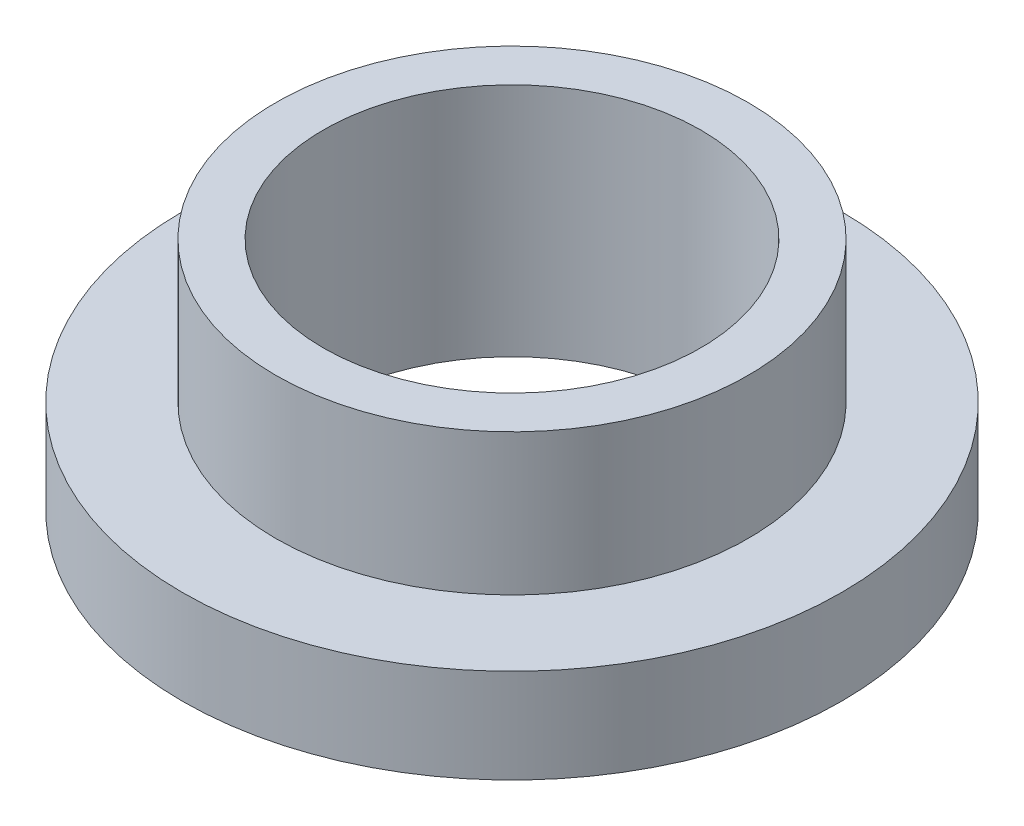
ISO-10303-21;
HEADER;
FILE_DESCRIPTION(('STEP AP214'),'2;1');
FILE_NAME('part.step','',(''),(''),'','','');
FILE_SCHEMA(('AUTOMOTIVE_DESIGN { 1 0 10303 214 1 1 1 1 }'));
ENDSEC;
DATA;
#1=APPLICATION_CONTEXT('core data for automotive mechanical design processes');
#2=APPLICATION_PROTOCOL_DEFINITION('international standard','automotive_design',2000,#1);
#3=PRODUCT_CONTEXT('',#1,'mechanical');
#4=PRODUCT('Part','Part','',(#3));
#5=PRODUCT_RELATED_PRODUCT_CATEGORY('part','',(#4));
#6=PRODUCT_DEFINITION_FORMATION('','',#4);
#7=PRODUCT_DEFINITION_CONTEXT('part definition',#1,'design');
#8=PRODUCT_DEFINITION('design','',#6,#7);
#9=PRODUCT_DEFINITION_SHAPE('','',#8);
#10=(LENGTH_UNIT() NAMED_UNIT(*) SI_UNIT(.MILLI.,.METRE.));
#11=(NAMED_UNIT(*) PLANE_ANGLE_UNIT() SI_UNIT($,.RADIAN.));
#12=(NAMED_UNIT(*) SI_UNIT($,.STERADIAN.) SOLID_ANGLE_UNIT());
#13=UNCERTAINTY_MEASURE_WITH_UNIT(LENGTH_MEASURE(1.E-05),#10,'distance_accuracy_value','');
#14=(GEOMETRIC_REPRESENTATION_CONTEXT(3) GLOBAL_UNCERTAINTY_ASSIGNED_CONTEXT((#13)) GLOBAL_UNIT_ASSIGNED_CONTEXT((#10,
#11,#12)) REPRESENTATION_CONTEXT('',''));
#15=CARTESIAN_POINT('',(0.,0.,0.));
#16=DIRECTION('',(0.,0.,1.));
#17=DIRECTION('',(1.,0.,0.));
#18=AXIS2_PLACEMENT_3D('',#15,#16,#17);
#19=CARTESIAN_POINT('',(0.,7.9375,0.));
#20=DIRECTION('',(0.,1.,0.));
#21=DIRECTION('',(0.,0.,1.));
#22=AXIS2_PLACEMENT_3D('',#19,#20,#21);
#23=PLANE('',#22);
#24=CARTESIAN_POINT('',(0.,7.9375,0.));
#25=DIRECTION('',(0.,1.,0.));
#26=DIRECTION('',(0.,0.,1.));
#27=AXIS2_PLACEMENT_3D('',#24,#25,#26);
#28=CIRCLE('',#27,7.9629);
#29=CARTESIAN_POINT('',(0.,7.9375,7.9629));
#30=VERTEX_POINT('',#29);
#31=EDGE_CURVE('E10',#30,#30,#28,.T.);
#32=ORIENTED_EDGE('',*,*,#31,.T.);
#33=EDGE_LOOP('',(#32));
#34=FACE_BOUND('',#33,.T.);
#35=CARTESIAN_POINT('',(0.,7.9375,0.));
#36=DIRECTION('',(0.,1.,0.));
#37=DIRECTION('',(0.,0.,1.));
#38=AXIS2_PLACEMENT_3D('',#35,#36,#37);
#39=CIRCLE('',#38,6.3627);
#40=CARTESIAN_POINT('',(0.,7.9375,6.3627));
#41=VERTEX_POINT('',#40);
#42=EDGE_CURVE('E37',#41,#41,#39,.T.);
#43=ORIENTED_EDGE('',*,*,#42,.F.);
#44=EDGE_LOOP('',(#43));
#45=FACE_BOUND('',#44,.T.);
#46=ADVANCED_FACE('F30',(#34,#45),#23,.T.);
#47=CARTESIAN_POINT('',(0.,0.,0.));
#48=DIRECTION('',(0.,1.,0.));
#49=DIRECTION('',(0.,0.,1.));
#50=AXIS2_PLACEMENT_3D('',#47,#48,#49);
#51=PLANE('',#50);
#52=CARTESIAN_POINT('',(0.,0.,0.));
#53=DIRECTION('',(0.,1.,0.));
#54=DIRECTION('',(0.,0.,1.));
#55=AXIS2_PLACEMENT_3D('',#52,#53,#54);
#56=CIRCLE('',#55,6.3627);
#57=CARTESIAN_POINT('',(0.,0.,6.3627));
#58=VERTEX_POINT('',#57);
#59=EDGE_CURVE('E41',#58,#58,#56,.T.);
#60=ORIENTED_EDGE('',*,*,#59,.T.);
#61=EDGE_LOOP('',(#60));
#62=FACE_BOUND('',#61,.T.);
#63=CARTESIAN_POINT('',(0.,0.,0.));
#64=DIRECTION('',(0.,1.,0.));
#65=DIRECTION('',(0.,0.,1.));
#66=AXIS2_PLACEMENT_3D('',#63,#64,#65);
#67=CIRCLE('',#66,11.1125);
#68=CARTESIAN_POINT('',(0.,0.,11.1125));
#69=VERTEX_POINT('',#68);
#70=EDGE_CURVE('E48',#69,#69,#67,.T.);
#71=ORIENTED_EDGE('',*,*,#70,.F.);
#72=EDGE_LOOP('',(#71));
#73=FACE_BOUND('',#72,.T.);
#74=ADVANCED_FACE('F73',(#62,#73),#51,.F.);
#75=CARTESIAN_POINT('',(0.,7.9375,0.));
#76=DIRECTION('',(0.,-1.,0.));
#77=DIRECTION('',(0.,0.,-1.));
#78=AXIS2_PLACEMENT_3D('',#75,#76,#77);
#79=CYLINDRICAL_SURFACE('',#78,7.9629);
#80=CARTESIAN_POINT('',(0.,3.175,0.));
#81=DIRECTION('',(0.,1.,0.));
#82=DIRECTION('',(0.,0.,1.));
#83=AXIS2_PLACEMENT_3D('',#80,#81,#82);
#84=CIRCLE('',#83,7.9629);
#85=CARTESIAN_POINT('',(0.,3.175,7.9629));
#86=VERTEX_POINT('',#85);
#87=EDGE_CURVE('E51',#86,#86,#84,.T.);
#88=ORIENTED_EDGE('',*,*,#87,.T.);
#89=EDGE_LOOP('',(#88));
#90=FACE_BOUND('',#89,.T.);
#91=ORIENTED_EDGE('',*,*,#31,.F.);
#92=EDGE_LOOP('',(#91));
#93=FACE_BOUND('',#92,.T.);
#94=ADVANCED_FACE('F32',(#90,#93),#79,.T.);
#95=CARTESIAN_POINT('',(0.,7.9375,0.));
#96=DIRECTION('',(0.,-1.,0.));
#97=DIRECTION('',(0.,0.,-1.));
#98=AXIS2_PLACEMENT_3D('',#95,#96,#97);
#99=CYLINDRICAL_SURFACE('',#98,6.3627);
#100=ORIENTED_EDGE('',*,*,#42,.T.);
#101=EDGE_LOOP('',(#100));
#102=FACE_BOUND('',#101,.T.);
#103=ORIENTED_EDGE('',*,*,#59,.F.);
#104=EDGE_LOOP('',(#103));
#105=FACE_BOUND('',#104,.T.);
#106=ADVANCED_FACE('F62',(#102,#105),#99,.F.);
#107=CARTESIAN_POINT('',(0.,3.175,0.));
#108=DIRECTION('',(0.,1.,0.));
#109=DIRECTION('',(0.,0.,1.));
#110=AXIS2_PLACEMENT_3D('',#107,#108,#109);
#111=PLANE('',#110);
#112=CARTESIAN_POINT('',(0.,3.175,0.));
#113=DIRECTION('',(0.,1.,0.));
#114=DIRECTION('',(0.,0.,1.));
#115=AXIS2_PLACEMENT_3D('',#112,#113,#114);
#116=CIRCLE('',#115,11.1125);
#117=CARTESIAN_POINT('',(0.,3.175,11.1125));
#118=VERTEX_POINT('',#117);
#119=EDGE_CURVE('E46',#118,#118,#116,.T.);
#120=ORIENTED_EDGE('',*,*,#119,.T.);
#121=EDGE_LOOP('',(#120));
#122=FACE_BOUND('',#121,.T.);
#123=ORIENTED_EDGE('',*,*,#87,.F.);
#124=EDGE_LOOP('',(#123));
#125=FACE_BOUND('',#124,.T.);
#126=ADVANCED_FACE('F59',(#122,#125),#111,.T.);
#127=CARTESIAN_POINT('',(0.,3.175,0.));
#128=DIRECTION('',(0.,-1.,0.));
#129=DIRECTION('',(0.,0.,-1.));
#130=AXIS2_PLACEMENT_3D('',#127,#128,#129);
#131=CYLINDRICAL_SURFACE('',#130,11.1125);
#132=ORIENTED_EDGE('',*,*,#119,.F.);
#133=EDGE_LOOP('',(#132));
#134=FACE_BOUND('',#133,.T.);
#135=ORIENTED_EDGE('',*,*,#70,.T.);
#136=EDGE_LOOP('',(#135));
#137=FACE_BOUND('',#136,.T.);
#138=ADVANCED_FACE('F61',(#134,#137),#131,.T.);
#139=CLOSED_SHELL('',(#46,#74,#94,#106,#126,#138));
#140=MANIFOLD_SOLID_BREP('B2',#139);
#141=ADVANCED_BREP_SHAPE_REPRESENTATION('',(#18,#140),#14);
#142=SHAPE_DEFINITION_REPRESENTATION(#9,#141);
ENDSEC;
END-ISO-10303-21;
